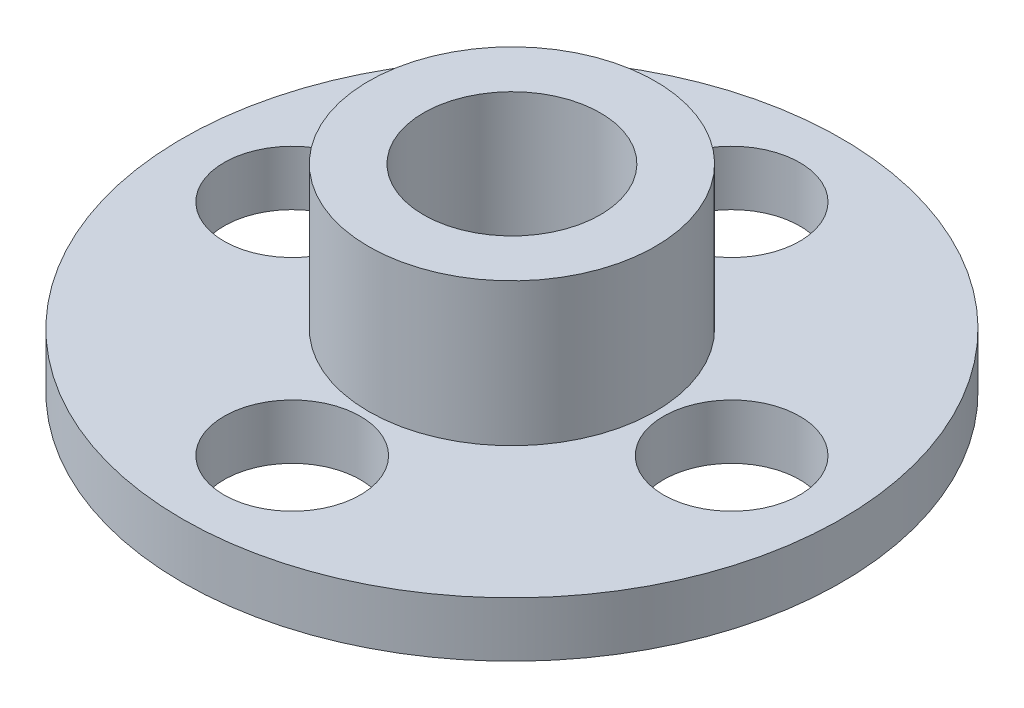
ISO-10303-21;
HEADER;
FILE_DESCRIPTION(('STEP AP214'),'2;1');
FILE_NAME('part.step','',(''),(''),'','','');
FILE_SCHEMA(('AUTOMOTIVE_DESIGN { 1 0 10303 214 1 1 1 1 }'));
ENDSEC;
DATA;
#1=APPLICATION_CONTEXT('core data for automotive mechanical design processes');
#2=APPLICATION_PROTOCOL_DEFINITION('international standard','automotive_design',2000,#1);
#3=PRODUCT_CONTEXT('',#1,'mechanical');
#4=PRODUCT('Part','Part','',(#3));
#5=PRODUCT_RELATED_PRODUCT_CATEGORY('part','',(#4));
#6=PRODUCT_DEFINITION_FORMATION('','',#4);
#7=PRODUCT_DEFINITION_CONTEXT('part definition',#1,'design');
#8=PRODUCT_DEFINITION('design','',#6,#7);
#9=PRODUCT_DEFINITION_SHAPE('','',#8);
#10=(LENGTH_UNIT() NAMED_UNIT(*) SI_UNIT(.MILLI.,.METRE.));
#11=(NAMED_UNIT(*) PLANE_ANGLE_UNIT() SI_UNIT($,.RADIAN.));
#12=(NAMED_UNIT(*) SI_UNIT($,.STERADIAN.) SOLID_ANGLE_UNIT());
#13=UNCERTAINTY_MEASURE_WITH_UNIT(LENGTH_MEASURE(1.E-05),#10,'distance_accuracy_value','');
#14=(GEOMETRIC_REPRESENTATION_CONTEXT(3) GLOBAL_UNCERTAINTY_ASSIGNED_CONTEXT((#13)) GLOBAL_UNIT_ASSIGNED_CONTEXT((#10,
#11,#12)) REPRESENTATION_CONTEXT('',''));
#15=CARTESIAN_POINT('',(0.,0.,0.));
#16=DIRECTION('',(0.,0.,1.));
#17=DIRECTION('',(1.,0.,0.));
#18=AXIS2_PLACEMENT_3D('',#15,#16,#17);
#19=CARTESIAN_POINT('',(0.,3.175,0.));
#20=DIRECTION('',(0.,1.,0.));
#21=DIRECTION('',(0.,0.,1.));
#22=AXIS2_PLACEMENT_3D('',#19,#20,#21);
#23=PLANE('',#22);
#24=CARTESIAN_POINT('',(0.,3.175,0.));
#25=DIRECTION('',(0.,1.,0.));
#26=DIRECTION('',(0.,0.,1.));
#27=AXIS2_PLACEMENT_3D('',#24,#25,#26);
#28=CIRCLE('',#27,5.08);
#29=CARTESIAN_POINT('',(0.,3.175,5.08));
#30=VERTEX_POINT('',#29);
#31=EDGE_CURVE('E51',#30,#30,#28,.T.);
#32=ORIENTED_EDGE('',*,*,#31,.F.);
#33=EDGE_LOOP('',(#32));
#34=FACE_BOUND('',#33,.T.);
#35=CARTESIAN_POINT('',(0.,3.175,0.));
#36=DIRECTION('',(0.,1.,0.));
#37=DIRECTION('',(0.,0.,1.));
#38=AXIS2_PLACEMENT_3D('',#35,#36,#37);
#39=CIRCLE('',#38,5.10925657634789);
#40=CARTESIAN_POINT('',(0.,3.175,5.10925657634789));
#41=VERTEX_POINT('',#40);
#42=EDGE_CURVE('E10',#41,#41,#39,.F.);
#43=ORIENTED_EDGE('',*,*,#42,.F.);
#44=EDGE_LOOP('',(#43));
#45=FACE_BOUND('',#44,.T.);
#46=ADVANCED_FACE('F35',(#34,#45),#23,.T.);
#47=CARTESIAN_POINT('',(0.,3.175,0.));
#48=DIRECTION('',(0.,1.,0.));
#49=DIRECTION('',(0.,0.,1.));
#50=AXIS2_PLACEMENT_3D('',#47,#48,#49);
#51=CIRCLE('',#50,8.28425657634789);
#52=CARTESIAN_POINT('',(0.,3.175,8.28425657634789));
#53=VERTEX_POINT('',#52);
#54=EDGE_CURVE('E83',#53,#53,#51,.T.);
#55=ORIENTED_EDGE('',*,*,#54,.F.);
#56=EDGE_LOOP('',(#55));
#57=FACE_BOUND('',#56,.T.);
#58=CARTESIAN_POINT('',(3.5628980546138E-13,3.175,12.7));
#59=DIRECTION('',(0.,1.,0.));
#60=DIRECTION('',(0.,0.,1.));
#61=AXIS2_PLACEMENT_3D('',#58,#59,#60);
#62=CIRCLE('',#61,3.94019806768997);
#63=CARTESIAN_POINT('',(3.5628980546138E-13,3.175,16.64019806769));
#64=VERTEX_POINT('',#63);
#65=EDGE_CURVE('E68',#64,#64,#62,.T.);
#66=ORIENTED_EDGE('',*,*,#65,.F.);
#67=EDGE_LOOP('',(#66));
#68=FACE_BOUND('',#67,.T.);
#69=CARTESIAN_POINT('',(0.,3.175,-12.7));
#70=DIRECTION('',(0.,1.,0.));
#71=DIRECTION('',(0.,0.,1.));
#72=AXIS2_PLACEMENT_3D('',#69,#70,#71);
#73=CIRCLE('',#72,3.94019806768954);
#74=CARTESIAN_POINT('',(0.,3.175,-8.75980193231046));
#75=VERTEX_POINT('',#74);
#76=EDGE_CURVE('E56',#75,#75,#73,.T.);
#77=ORIENTED_EDGE('',*,*,#76,.F.);
#78=EDGE_LOOP('',(#77));
#79=FACE_BOUND('',#78,.T.);
#80=CARTESIAN_POINT('',(0.,3.175,0.));
#81=DIRECTION('',(0.,1.,0.));
#82=DIRECTION('',(0.,0.,1.));
#83=AXIS2_PLACEMENT_3D('',#80,#81,#82);
#84=CIRCLE('',#83,19.05);
#85=CARTESIAN_POINT('',(0.,3.175,19.05));
#86=VERTEX_POINT('',#85);
#87=EDGE_CURVE('E42',#86,#86,#84,.T.);
#88=ORIENTED_EDGE('',*,*,#87,.T.);
#89=EDGE_LOOP('',(#88));
#90=FACE_BOUND('',#89,.T.);
#91=CARTESIAN_POINT('',(12.7,3.175,0.));
#92=DIRECTION('',(0.,1.,0.));
#93=DIRECTION('',(0.,0.,1.));
#94=AXIS2_PLACEMENT_3D('',#91,#92,#93);
#95=CIRCLE('',#94,3.94019806768954);
#96=CARTESIAN_POINT('',(12.7,3.175,3.94019806768958));
#97=VERTEX_POINT('',#96);
#98=EDGE_CURVE('E62',#97,#97,#95,.T.);
#99=ORIENTED_EDGE('',*,*,#98,.F.);
#100=EDGE_LOOP('',(#99));
#101=FACE_BOUND('',#100,.T.);
#102=CARTESIAN_POINT('',(-12.7,3.175,-1.33025439009923E-13));
#103=DIRECTION('',(0.,1.,0.));
#104=DIRECTION('',(0.,0.,1.));
#105=AXIS2_PLACEMENT_3D('',#102,#103,#104);
#106=CIRCLE('',#105,3.94019806768954);
#107=CARTESIAN_POINT('',(-12.7,3.175,3.94019806768941));
#108=VERTEX_POINT('',#107);
#109=EDGE_CURVE('E74',#108,#108,#106,.T.);
#110=ORIENTED_EDGE('',*,*,#109,.F.);
#111=EDGE_LOOP('',(#110));
#112=FACE_BOUND('',#111,.T.);
#113=ADVANCED_FACE('F111',(#57,#68,#79,#90,#101,#112),#23,.T.);
#114=CARTESIAN_POINT('',(0.,0.,0.));
#115=DIRECTION('',(0.,1.,0.));
#116=DIRECTION('',(0.,0.,1.));
#117=AXIS2_PLACEMENT_3D('',#114,#115,#116);
#118=PLANE('',#117);
#119=CARTESIAN_POINT('',(0.,0.,0.));
#120=DIRECTION('',(0.,1.,0.));
#121=DIRECTION('',(0.,0.,1.));
#122=AXIS2_PLACEMENT_3D('',#119,#120,#121);
#123=CIRCLE('',#122,19.05);
#124=CARTESIAN_POINT('',(0.,0.,19.05));
#125=VERTEX_POINT('',#124);
#126=EDGE_CURVE('E46',#125,#125,#123,.T.);
#127=ORIENTED_EDGE('',*,*,#126,.F.);
#128=EDGE_LOOP('',(#127));
#129=FACE_BOUND('',#128,.T.);
#130=CARTESIAN_POINT('',(0.,0.,0.));
#131=DIRECTION('',(0.,1.,0.));
#132=DIRECTION('',(0.,0.,1.));
#133=AXIS2_PLACEMENT_3D('',#130,#131,#132);
#134=CIRCLE('',#133,5.08);
#135=CARTESIAN_POINT('',(0.,0.,5.08));
#136=VERTEX_POINT('',#135);
#137=EDGE_CURVE('E53',#136,#136,#134,.T.);
#138=ORIENTED_EDGE('',*,*,#137,.T.);
#139=EDGE_LOOP('',(#138));
#140=FACE_BOUND('',#139,.T.);
#141=CARTESIAN_POINT('',(0.,0.,-12.7));
#142=DIRECTION('',(0.,1.,0.));
#143=DIRECTION('',(0.,0.,1.));
#144=AXIS2_PLACEMENT_3D('',#141,#142,#143);
#145=CIRCLE('',#144,3.94019806768954);
#146=CARTESIAN_POINT('',(0.,0.,-8.75980193231046));
#147=VERTEX_POINT('',#146);
#148=EDGE_CURVE('E59',#147,#147,#145,.T.);
#149=ORIENTED_EDGE('',*,*,#148,.T.);
#150=EDGE_LOOP('',(#149));
#151=FACE_BOUND('',#150,.T.);
#152=CARTESIAN_POINT('',(12.7,0.,0.));
#153=DIRECTION('',(0.,1.,0.));
#154=DIRECTION('',(0.,0.,1.));
#155=AXIS2_PLACEMENT_3D('',#152,#153,#154);
#156=CIRCLE('',#155,3.94019806768954);
#157=CARTESIAN_POINT('',(12.7,0.,3.94019806768958));
#158=VERTEX_POINT('',#157);
#159=EDGE_CURVE('E65',#158,#158,#156,.T.);
#160=ORIENTED_EDGE('',*,*,#159,.T.);
#161=EDGE_LOOP('',(#160));
#162=FACE_BOUND('',#161,.T.);
#163=CARTESIAN_POINT('',(3.5628980546138E-13,0.,12.7));
#164=DIRECTION('',(0.,1.,0.));
#165=DIRECTION('',(0.,0.,1.));
#166=AXIS2_PLACEMENT_3D('',#163,#164,#165);
#167=CIRCLE('',#166,3.94019806768997);
#168=CARTESIAN_POINT('',(3.5628980546138E-13,0.,16.64019806769));
#169=VERTEX_POINT('',#168);
#170=EDGE_CURVE('E71',#169,#169,#167,.T.);
#171=ORIENTED_EDGE('',*,*,#170,.T.);
#172=EDGE_LOOP('',(#171));
#173=FACE_BOUND('',#172,.T.);
#174=CARTESIAN_POINT('',(-12.7,0.,-1.33025439009923E-13));
#175=DIRECTION('',(0.,1.,0.));
#176=DIRECTION('',(0.,0.,1.));
#177=AXIS2_PLACEMENT_3D('',#174,#175,#176);
#178=CIRCLE('',#177,3.94019806768954);
#179=CARTESIAN_POINT('',(-12.7,0.,3.94019806768941));
#180=VERTEX_POINT('',#179);
#181=EDGE_CURVE('E77',#180,#180,#178,.T.);
#182=ORIENTED_EDGE('',*,*,#181,.T.);
#183=EDGE_LOOP('',(#182));
#184=FACE_BOUND('',#183,.T.);
#185=ADVANCED_FACE('F117',(#129,#140,#151,#162,#173,#184),#118,.F.);
#186=CARTESIAN_POINT('',(0.,3.175,0.));
#187=DIRECTION('',(0.,-1.,0.));
#188=DIRECTION('',(0.,0.,-1.));
#189=AXIS2_PLACEMENT_3D('',#186,#187,#188);
#190=CYLINDRICAL_SURFACE('',#189,19.05);
#191=ORIENTED_EDGE('',*,*,#87,.F.);
#192=EDGE_LOOP('',(#191));
#193=FACE_BOUND('',#192,.T.);
#194=ORIENTED_EDGE('',*,*,#126,.T.);
#195=EDGE_LOOP('',(#194));
#196=FACE_BOUND('',#195,.T.);
#197=ADVANCED_FACE('F37',(#193,#196),#190,.T.);
#198=CARTESIAN_POINT('',(0.,3.175,0.));
#199=DIRECTION('',(0.,-1.,0.));
#200=DIRECTION('',(0.,0.,-1.));
#201=AXIS2_PLACEMENT_3D('',#198,#199,#200);
#202=CYLINDRICAL_SURFACE('',#201,5.08);
#203=ORIENTED_EDGE('',*,*,#31,.T.);
#204=EDGE_LOOP('',(#203));
#205=FACE_BOUND('',#204,.T.);
#206=ORIENTED_EDGE('',*,*,#137,.F.);
#207=EDGE_LOOP('',(#206));
#208=FACE_BOUND('',#207,.T.);
#209=ADVANCED_FACE('F122',(#205,#208),#202,.F.);
#210=CARTESIAN_POINT('',(0.,3.175,-12.7));
#211=DIRECTION('',(0.,-1.,0.));
#212=DIRECTION('',(0.,0.,-1.));
#213=AXIS2_PLACEMENT_3D('',#210,#211,#212);
#214=CYLINDRICAL_SURFACE('',#213,3.94019806768954);
#215=ORIENTED_EDGE('',*,*,#76,.T.);
#216=EDGE_LOOP('',(#215));
#217=FACE_BOUND('',#216,.T.);
#218=ORIENTED_EDGE('',*,*,#148,.F.);
#219=EDGE_LOOP('',(#218));
#220=FACE_BOUND('',#219,.T.);
#221=ADVANCED_FACE('F150',(#217,#220),#214,.F.);
#222=CARTESIAN_POINT('',(12.7,3.175,0.));
#223=DIRECTION('',(0.,-1.,0.));
#224=DIRECTION('',(0.,0.,-1.));
#225=AXIS2_PLACEMENT_3D('',#222,#223,#224);
#226=CYLINDRICAL_SURFACE('',#225,3.94019806768954);
#227=ORIENTED_EDGE('',*,*,#98,.T.);
#228=EDGE_LOOP('',(#227));
#229=FACE_BOUND('',#228,.T.);
#230=ORIENTED_EDGE('',*,*,#159,.F.);
#231=EDGE_LOOP('',(#230));
#232=FACE_BOUND('',#231,.T.);
#233=ADVANCED_FACE('F144',(#229,#232),#226,.F.);
#234=CARTESIAN_POINT('',(3.5628980546138E-13,3.175,12.7));
#235=DIRECTION('',(0.,-1.,0.));
#236=DIRECTION('',(0.,0.,-1.));
#237=AXIS2_PLACEMENT_3D('',#234,#235,#236);
#238=CYLINDRICAL_SURFACE('',#237,3.94019806768997);
#239=ORIENTED_EDGE('',*,*,#65,.T.);
#240=EDGE_LOOP('',(#239));
#241=FACE_BOUND('',#240,.T.);
#242=ORIENTED_EDGE('',*,*,#170,.F.);
#243=EDGE_LOOP('',(#242));
#244=FACE_BOUND('',#243,.T.);
#245=ADVANCED_FACE('F106',(#241,#244),#238,.F.);
#246=CARTESIAN_POINT('',(-12.7,3.175,-1.33025439009923E-13));
#247=DIRECTION('',(0.,-1.,0.));
#248=DIRECTION('',(0.,0.,-1.));
#249=AXIS2_PLACEMENT_3D('',#246,#247,#248);
#250=CYLINDRICAL_SURFACE('',#249,3.94019806768954);
#251=ORIENTED_EDGE('',*,*,#109,.T.);
#252=EDGE_LOOP('',(#251));
#253=FACE_BOUND('',#252,.T.);
#254=ORIENTED_EDGE('',*,*,#181,.F.);
#255=EDGE_LOOP('',(#254));
#256=FACE_BOUND('',#255,.T.);
#257=ADVANCED_FACE('F97',(#253,#256),#250,.F.);
#258=CARTESIAN_POINT('',(0.,11.43,0.));
#259=DIRECTION('',(0.,1.,0.));
#260=DIRECTION('',(0.,0.,1.));
#261=AXIS2_PLACEMENT_3D('',#258,#259,#260);
#262=PLANE('',#261);
#263=CARTESIAN_POINT('',(0.,11.43,0.));
#264=DIRECTION('',(0.,1.,0.));
#265=DIRECTION('',(0.,0.,1.));
#266=AXIS2_PLACEMENT_3D('',#263,#264,#265);
#267=CIRCLE('',#266,8.28425657634789);
#268=CARTESIAN_POINT('',(0.,11.43,8.28425657634789));
#269=VERTEX_POINT('',#268);
#270=EDGE_CURVE('E80',#269,#269,#267,.T.);
#271=ORIENTED_EDGE('',*,*,#270,.T.);
#272=EDGE_LOOP('',(#271));
#273=FACE_BOUND('',#272,.T.);
#274=CARTESIAN_POINT('',(0.,11.43,0.));
#275=DIRECTION('',(0.,1.,0.));
#276=DIRECTION('',(0.,0.,1.));
#277=AXIS2_PLACEMENT_3D('',#274,#275,#276);
#278=CIRCLE('',#277,5.10925657634789);
#279=CARTESIAN_POINT('',(0.,11.43,5.10925657634789));
#280=VERTEX_POINT('',#279);
#281=EDGE_CURVE('E86',#280,#280,#278,.T.);
#282=ORIENTED_EDGE('',*,*,#281,.F.);
#283=EDGE_LOOP('',(#282));
#284=FACE_BOUND('',#283,.T.);
#285=ADVANCED_FACE('F94',(#273,#284),#262,.T.);
#286=CARTESIAN_POINT('',(0.,11.43,0.));
#287=DIRECTION('',(0.,-1.,0.));
#288=DIRECTION('',(0.,0.,-1.));
#289=AXIS2_PLACEMENT_3D('',#286,#287,#288);
#290=CYLINDRICAL_SURFACE('',#289,8.28425657634789);
#291=ORIENTED_EDGE('',*,*,#270,.F.);
#292=EDGE_LOOP('',(#291));
#293=FACE_BOUND('',#292,.T.);
#294=ORIENTED_EDGE('',*,*,#54,.T.);
#295=EDGE_LOOP('',(#294));
#296=FACE_BOUND('',#295,.T.);
#297=ADVANCED_FACE('F96',(#293,#296),#290,.T.);
#298=CARTESIAN_POINT('',(0.,11.43,0.));
#299=DIRECTION('',(0.,-1.,0.));
#300=DIRECTION('',(0.,0.,-1.));
#301=AXIS2_PLACEMENT_3D('',#298,#299,#300);
#302=CYLINDRICAL_SURFACE('',#301,5.10925657634789);
#303=ORIENTED_EDGE('',*,*,#281,.T.);
#304=EDGE_LOOP('',(#303));
#305=FACE_BOUND('',#304,.T.);
#306=ORIENTED_EDGE('',*,*,#42,.T.);
#307=EDGE_LOOP('',(#306));
#308=FACE_BOUND('',#307,.T.);
#309=ADVANCED_FACE('F92',(#305,#308),#302,.F.);
#310=CLOSED_SHELL('',(#46,#113,#185,#197,#209,#221,#233,#245,#257,#285,#297,#309));
#311=MANIFOLD_SOLID_BREP('B2',#310);
#312=ADVANCED_BREP_SHAPE_REPRESENTATION('',(#18,#311),#14);
#313=SHAPE_DEFINITION_REPRESENTATION(#9,#312);
ENDSEC;
END-ISO-10303-21;
